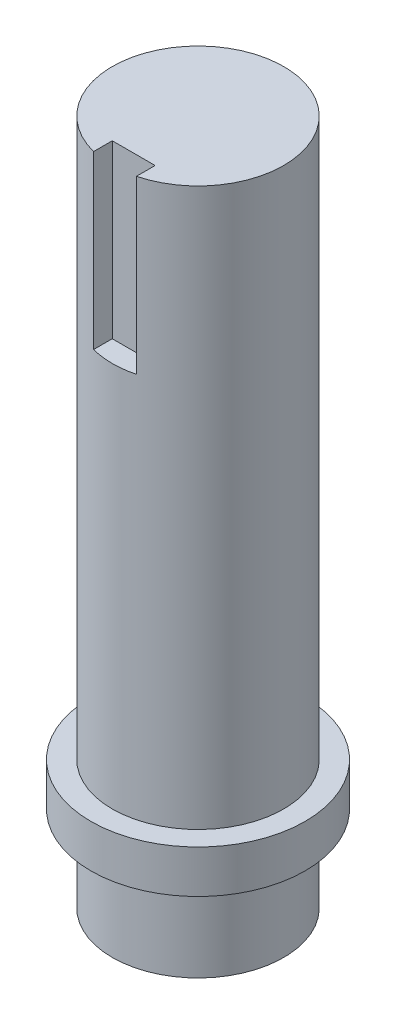
ISO-10303-21;
HEADER;
FILE_DESCRIPTION(('STEP AP214'),'2;1');
FILE_NAME('part.step','',(''),(''),'','','');
FILE_SCHEMA(('AUTOMOTIVE_DESIGN { 1 0 10303 214 1 1 1 1 }'));
ENDSEC;
DATA;
#1=APPLICATION_CONTEXT('core data for automotive mechanical design processes');
#2=APPLICATION_PROTOCOL_DEFINITION('international standard','automotive_design',2000,#1);
#3=PRODUCT_CONTEXT('',#1,'mechanical');
#4=PRODUCT('Part','Part','',(#3));
#5=PRODUCT_RELATED_PRODUCT_CATEGORY('part','',(#4));
#6=PRODUCT_DEFINITION_FORMATION('','',#4);
#7=PRODUCT_DEFINITION_CONTEXT('part definition',#1,'design');
#8=PRODUCT_DEFINITION('design','',#6,#7);
#9=PRODUCT_DEFINITION_SHAPE('','',#8);
#10=(LENGTH_UNIT() NAMED_UNIT(*) SI_UNIT(.MILLI.,.METRE.));
#11=(NAMED_UNIT(*) PLANE_ANGLE_UNIT() SI_UNIT($,.RADIAN.));
#12=(NAMED_UNIT(*) SI_UNIT($,.STERADIAN.) SOLID_ANGLE_UNIT());
#13=UNCERTAINTY_MEASURE_WITH_UNIT(LENGTH_MEASURE(1.E-05),#10,'distance_accuracy_value','');
#14=(GEOMETRIC_REPRESENTATION_CONTEXT(3) GLOBAL_UNCERTAINTY_ASSIGNED_CONTEXT((#13)) GLOBAL_UNIT_ASSIGNED_CONTEXT((#10,
#11,#12)) REPRESENTATION_CONTEXT('',''));
#15=CARTESIAN_POINT('',(0.,0.,0.));
#16=DIRECTION('',(0.,0.,1.));
#17=DIRECTION('',(1.,0.,0.));
#18=AXIS2_PLACEMENT_3D('',#15,#16,#17);
#19=CARTESIAN_POINT('',(0.,101.6,0.));
#20=DIRECTION('',(0.,-1.,0.));
#21=DIRECTION('',(0.,0.,-1.));
#22=AXIS2_PLACEMENT_3D('',#19,#20,#21);
#23=CYLINDRICAL_SURFACE('',#22,15.875);
#24=CARTESIAN_POINT('',(0.,19.05,0.));
#25=DIRECTION('',(0.,1.,0.));
#26=DIRECTION('',(0.,0.,1.));
#27=AXIS2_PLACEMENT_3D('',#24,#25,#26);
#28=CIRCLE('',#27,15.875);
#29=CARTESIAN_POINT('',(0.,19.05,15.875));
#30=VERTEX_POINT('',#29);
#31=EDGE_CURVE('E104',#30,#30,#28,.T.);
#32=ORIENTED_EDGE('',*,*,#31,.F.);
#33=EDGE_LOOP('',(#32));
#34=FACE_BOUND('',#33,.T.);
#35=CARTESIAN_POINT('',(0.,12.7,0.));
#36=DIRECTION('',(0.,-1.,0.));
#37=DIRECTION('',(0.,0.,-1.));
#38=AXIS2_PLACEMENT_3D('',#35,#36,#37);
#39=CIRCLE('',#38,15.875);
#40=CARTESIAN_POINT('',(0.,12.7,-15.875));
#41=VERTEX_POINT('',#40);
#42=EDGE_CURVE('E36',#41,#41,#39,.T.);
#43=ORIENTED_EDGE('',*,*,#42,.F.);
#44=EDGE_LOOP('',(#43));
#45=FACE_BOUND('',#44,.T.);
#46=ADVANCED_FACE('F33',(#34,#45),#23,.T.);
#47=CARTESIAN_POINT('',(0.,19.05,0.));
#48=DIRECTION('',(0.,1.,0.));
#49=DIRECTION('',(0.,0.,1.));
#50=AXIS2_PLACEMENT_3D('',#47,#48,#49);
#51=PLANE('',#50);
#52=CARTESIAN_POINT('',(0.,19.05,0.));
#53=DIRECTION('',(0.,1.,0.));
#54=DIRECTION('',(0.,0.,1.));
#55=AXIS2_PLACEMENT_3D('',#52,#53,#54);
#56=CIRCLE('',#55,12.7);
#57=CARTESIAN_POINT('',(0.,19.05,12.7));
#58=VERTEX_POINT('',#57);
#59=EDGE_CURVE('E101',#58,#58,#56,.T.);
#60=ORIENTED_EDGE('',*,*,#59,.F.);
#61=EDGE_LOOP('',(#60));
#62=FACE_BOUND('',#61,.T.);
#63=ORIENTED_EDGE('',*,*,#31,.T.);
#64=EDGE_LOOP('',(#63));
#65=FACE_BOUND('',#64,.T.);
#66=ADVANCED_FACE('F111',(#62,#65),#51,.T.);
#67=CARTESIAN_POINT('',(0.,19.05,0.));
#68=DIRECTION('',(0.,1.,0.));
#69=DIRECTION('',(0.,0.,1.));
#70=AXIS2_PLACEMENT_3D('',#67,#68,#69);
#71=CYLINDRICAL_SURFACE('',#70,12.7);
#72=DIRECTION('',(0.,1.,0.));
#73=VECTOR('',#72,1.);
#74=CARTESIAN_POINT('',(3.175,19.05,12.2967221242085));
#75=LINE('',#74,#73);
#76=CARTESIAN_POINT('',(3.175,76.2,12.2967221242085));
#77=VERTEX_POINT('',#76);
#78=CARTESIAN_POINT('',(3.175,101.6,12.2967221242085));
#79=VERTEX_POINT('',#78);
#80=EDGE_CURVE('E98',#77,#79,#75,.T.);
#81=ORIENTED_EDGE('',*,*,#80,.F.);
#82=CARTESIAN_POINT('',(0.,76.2,0.));
#83=DIRECTION('',(0.,-1.,0.));
#84=DIRECTION('',(0.,0.,-1.));
#85=AXIS2_PLACEMENT_3D('',#82,#83,#84);
#86=CIRCLE('',#85,12.7);
#87=CARTESIAN_POINT('',(-3.175,76.2,12.2967221242085));
#88=VERTEX_POINT('',#87);
#89=EDGE_CURVE('E12',#88,#77,#86,.F.);
#90=ORIENTED_EDGE('',*,*,#89,.F.);
#91=DIRECTION('',(0.,1.,0.));
#92=VECTOR('',#91,1.);
#93=CARTESIAN_POINT('',(-3.175,19.05,12.2967221242085));
#94=LINE('',#93,#92);
#95=CARTESIAN_POINT('',(-3.175,101.6,12.2967221242085));
#96=VERTEX_POINT('',#95);
#97=EDGE_CURVE('E95',#96,#88,#94,.F.);
#98=ORIENTED_EDGE('',*,*,#97,.F.);
#99=CARTESIAN_POINT('',(0.,101.6,0.));
#100=DIRECTION('',(0.,1.,0.));
#101=DIRECTION('',(0.,0.,1.));
#102=AXIS2_PLACEMENT_3D('',#99,#100,#101);
#103=CIRCLE('',#102,12.7);
#104=EDGE_CURVE('E100',#79,#96,#103,.T.);
#105=ORIENTED_EDGE('',*,*,#104,.F.);
#106=EDGE_LOOP('',(#81,#90,#98,#105));
#107=FACE_BOUND('',#106,.T.);
#108=ORIENTED_EDGE('',*,*,#59,.T.);
#109=EDGE_LOOP('',(#108));
#110=FACE_BOUND('',#109,.T.);
#111=ADVANCED_FACE('F151',(#107,#110),#71,.T.);
#112=CARTESIAN_POINT('',(0.,101.6,0.));
#113=DIRECTION('',(0.,1.,0.));
#114=DIRECTION('',(0.,0.,1.));
#115=AXIS2_PLACEMENT_3D('',#112,#113,#114);
#116=PLANE('',#115);
#117=DIRECTION('',(0.,0.,-1.));
#118=VECTOR('',#117,1.);
#119=CARTESIAN_POINT('',(3.175,101.6,0.));
#120=LINE('',#119,#118);
#121=CARTESIAN_POINT('',(3.175,101.6,9.525));
#122=VERTEX_POINT('',#121);
#123=EDGE_CURVE('E41',#79,#122,#120,.T.);
#124=ORIENTED_EDGE('',*,*,#123,.F.);
#125=ORIENTED_EDGE('',*,*,#104,.T.);
#126=DIRECTION('',(0.,0.,1.));
#127=VECTOR('',#126,1.);
#128=CARTESIAN_POINT('',(-3.175,101.6,15.875));
#129=LINE('',#128,#127);
#130=CARTESIAN_POINT('',(-3.175,101.6,9.525));
#131=VERTEX_POINT('',#130);
#132=EDGE_CURVE('E78',#131,#96,#129,.T.);
#133=ORIENTED_EDGE('',*,*,#132,.F.);
#134=DIRECTION('',(-1.,0.,0.));
#135=VECTOR('',#134,1.);
#136=CARTESIAN_POINT('',(-3.175,101.6,9.525));
#137=LINE('',#136,#135);
#138=EDGE_CURVE('E92',#122,#131,#137,.T.);
#139=ORIENTED_EDGE('',*,*,#138,.F.);
#140=EDGE_LOOP('',(#124,#125,#133,#139));
#141=FACE_BOUND('',#140,.T.);
#142=ADVANCED_FACE('F150',(#141),#116,.T.);
#143=CARTESIAN_POINT('',(3.175,76.2,15.875));
#144=DIRECTION('',(1.,0.,0.));
#145=DIRECTION('',(0.,0.,-1.));
#146=AXIS2_PLACEMENT_3D('',#143,#144,#145);
#147=PLANE('',#146);
#148=ORIENTED_EDGE('',*,*,#80,.T.);
#149=ORIENTED_EDGE('',*,*,#123,.T.);
#150=DIRECTION('',(0.,1.,0.));
#151=VECTOR('',#150,1.);
#152=CARTESIAN_POINT('',(3.175,76.2,9.525));
#153=LINE('',#152,#151);
#154=CARTESIAN_POINT('',(3.175,76.2,9.525));
#155=VERTEX_POINT('',#154);
#156=EDGE_CURVE('E48',#155,#122,#153,.T.);
#157=ORIENTED_EDGE('',*,*,#156,.F.);
#158=DIRECTION('',(0.,0.,-1.));
#159=VECTOR('',#158,1.);
#160=CARTESIAN_POINT('',(3.175,76.2,15.875));
#161=LINE('',#160,#159);
#162=EDGE_CURVE('E73',#77,#155,#161,.T.);
#163=ORIENTED_EDGE('',*,*,#162,.F.);
#164=EDGE_LOOP('',(#148,#149,#157,#163));
#165=FACE_BOUND('',#164,.T.);
#166=ADVANCED_FACE('F80',(#165),#147,.F.);
#167=CARTESIAN_POINT('',(-3.175,76.2,15.875));
#168=DIRECTION('',(-1.,0.,0.));
#169=DIRECTION('',(0.,0.,1.));
#170=AXIS2_PLACEMENT_3D('',#167,#168,#169);
#171=PLANE('',#170);
#172=ORIENTED_EDGE('',*,*,#97,.T.);
#173=DIRECTION('',(0.,0.,1.));
#174=VECTOR('',#173,1.);
#175=CARTESIAN_POINT('',(-3.175,76.2,15.875));
#176=LINE('',#175,#174);
#177=CARTESIAN_POINT('',(-3.175,76.2,9.525));
#178=VERTEX_POINT('',#177);
#179=EDGE_CURVE('E84',#178,#88,#176,.T.);
#180=ORIENTED_EDGE('',*,*,#179,.F.);
#181=DIRECTION('',(0.,1.,0.));
#182=VECTOR('',#181,1.);
#183=CARTESIAN_POINT('',(-3.175,76.2,9.525));
#184=LINE('',#183,#182);
#185=EDGE_CURVE('E83',#178,#131,#184,.T.);
#186=ORIENTED_EDGE('',*,*,#185,.T.);
#187=ORIENTED_EDGE('',*,*,#132,.T.);
#188=EDGE_LOOP('',(#172,#180,#186,#187));
#189=FACE_BOUND('',#188,.T.);
#190=ADVANCED_FACE('F142',(#189),#171,.F.);
#191=CARTESIAN_POINT('',(-3.175,76.2,9.525));
#192=DIRECTION('',(0.,0.,-1.));
#193=DIRECTION('',(-1.,0.,0.));
#194=AXIS2_PLACEMENT_3D('',#191,#192,#193);
#195=PLANE('',#194);
#196=ORIENTED_EDGE('',*,*,#138,.T.);
#197=ORIENTED_EDGE('',*,*,#185,.F.);
#198=DIRECTION('',(-1.,0.,0.));
#199=VECTOR('',#198,1.);
#200=CARTESIAN_POINT('',(-3.175,76.2,9.525));
#201=LINE('',#200,#199);
#202=EDGE_CURVE('E75',#155,#178,#201,.T.);
#203=ORIENTED_EDGE('',*,*,#202,.F.);
#204=ORIENTED_EDGE('',*,*,#156,.T.);
#205=EDGE_LOOP('',(#196,#197,#203,#204));
#206=FACE_BOUND('',#205,.T.);
#207=ADVANCED_FACE('F86',(#206),#195,.F.);
#208=CARTESIAN_POINT('',(3.175,76.2,9.525));
#209=DIRECTION('',(0.,-1.,0.));
#210=DIRECTION('',(0.,0.,-1.));
#211=AXIS2_PLACEMENT_3D('',#208,#209,#210);
#212=PLANE('',#211);
#213=ORIENTED_EDGE('',*,*,#89,.T.);
#214=ORIENTED_EDGE('',*,*,#162,.T.);
#215=ORIENTED_EDGE('',*,*,#202,.T.);
#216=ORIENTED_EDGE('',*,*,#179,.T.);
#217=EDGE_LOOP('',(#213,#214,#215,#216));
#218=FACE_BOUND('',#217,.T.);
#219=ADVANCED_FACE('F74',(#218),#212,.F.);
#220=CARTESIAN_POINT('',(0.,12.7,0.));
#221=DIRECTION('',(0.,-1.,0.));
#222=DIRECTION('',(0.,0.,-1.));
#223=AXIS2_PLACEMENT_3D('',#220,#221,#222);
#224=PLANE('',#223);
#225=CARTESIAN_POINT('',(0.,12.7,0.));
#226=DIRECTION('',(0.,-1.,0.));
#227=DIRECTION('',(0.,0.,-1.));
#228=AXIS2_PLACEMENT_3D('',#225,#226,#227);
#229=CIRCLE('',#228,12.7);
#230=CARTESIAN_POINT('',(0.,12.7,-12.7));
#231=VERTEX_POINT('',#230);
#232=EDGE_CURVE('E118',#231,#231,#229,.T.);
#233=ORIENTED_EDGE('',*,*,#232,.F.);
#234=EDGE_LOOP('',(#233));
#235=FACE_BOUND('',#234,.T.);
#236=ORIENTED_EDGE('',*,*,#42,.T.);
#237=EDGE_LOOP('',(#236));
#238=FACE_BOUND('',#237,.T.);
#239=ADVANCED_FACE('F131',(#235,#238),#224,.T.);
#240=CARTESIAN_POINT('',(0.,12.7,0.));
#241=DIRECTION('',(0.,-1.,0.));
#242=DIRECTION('',(0.,0.,-1.));
#243=AXIS2_PLACEMENT_3D('',#240,#241,#242);
#244=CYLINDRICAL_SURFACE('',#243,12.7);
#245=ORIENTED_EDGE('',*,*,#232,.T.);
#246=EDGE_LOOP('',(#245));
#247=FACE_BOUND('',#246,.T.);
#248=CARTESIAN_POINT('',(0.,0.,0.));
#249=DIRECTION('',(0.,-1.,0.));
#250=DIRECTION('',(0.,0.,-1.));
#251=AXIS2_PLACEMENT_3D('',#248,#249,#250);
#252=CIRCLE('',#251,12.7);
#253=CARTESIAN_POINT('',(0.,0.,-12.7));
#254=VERTEX_POINT('',#253);
#255=EDGE_CURVE('E120',#254,#254,#252,.T.);
#256=ORIENTED_EDGE('',*,*,#255,.F.);
#257=EDGE_LOOP('',(#256));
#258=FACE_BOUND('',#257,.T.);
#259=ADVANCED_FACE('F129',(#247,#258),#244,.T.);
#260=CARTESIAN_POINT('',(0.,0.,0.));
#261=DIRECTION('',(0.,1.,0.));
#262=DIRECTION('',(0.,0.,1.));
#263=AXIS2_PLACEMENT_3D('',#260,#261,#262);
#264=PLANE('',#263);
#265=ORIENTED_EDGE('',*,*,#255,.T.);
#266=EDGE_LOOP('',(#265));
#267=FACE_BOUND('',#266,.T.);
#268=ADVANCED_FACE('F127',(#267),#264,.F.);
#269=CLOSED_SHELL('',(#46,#66,#111,#142,#166,#190,#207,#219,#239,#259,#268));
#270=MANIFOLD_SOLID_BREP('B2',#269);
#271=ADVANCED_BREP_SHAPE_REPRESENTATION('',(#18,#270),#14);
#272=SHAPE_DEFINITION_REPRESENTATION(#9,#271);
ENDSEC;
END-ISO-10303-21;
